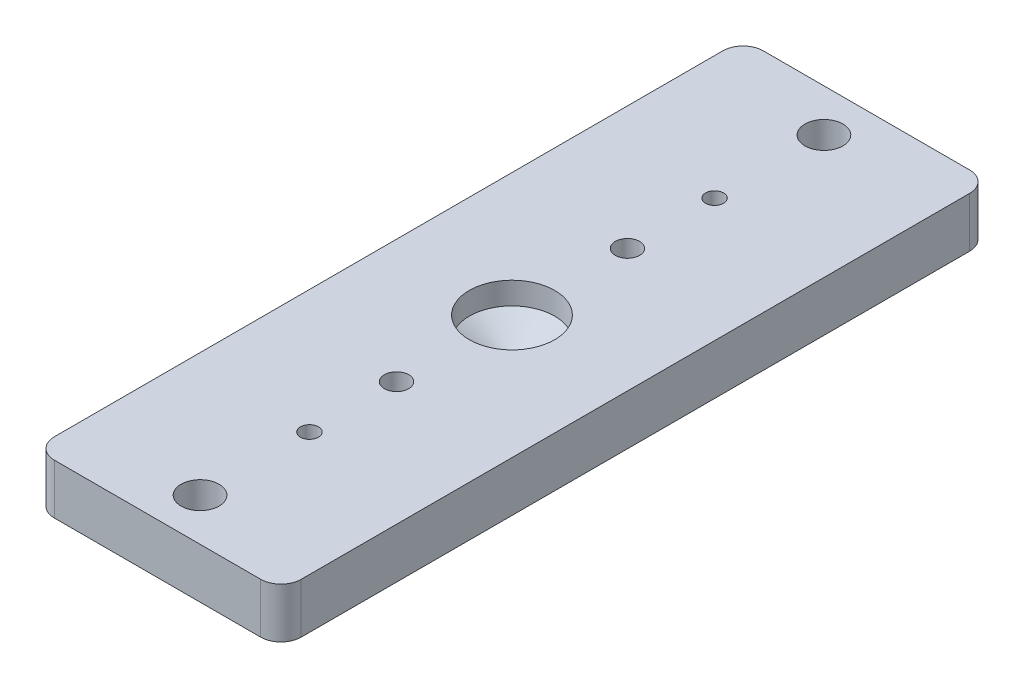
ISO-10303-21;
HEADER;
FILE_DESCRIPTION(('STEP AP214'),'2;1');
FILE_NAME('part.step','',(''),(''),'','','');
FILE_SCHEMA(('AUTOMOTIVE_DESIGN { 1 0 10303 214 1 1 1 1 }'));
ENDSEC;
DATA;
#1=APPLICATION_CONTEXT('core data for automotive mechanical design processes');
#2=APPLICATION_PROTOCOL_DEFINITION('international standard','automotive_design',2000,#1);
#3=PRODUCT_CONTEXT('',#1,'mechanical');
#4=PRODUCT('Part','Part','',(#3));
#5=PRODUCT_RELATED_PRODUCT_CATEGORY('part','',(#4));
#6=PRODUCT_DEFINITION_FORMATION('','',#4);
#7=PRODUCT_DEFINITION_CONTEXT('part definition',#1,'design');
#8=PRODUCT_DEFINITION('design','',#6,#7);
#9=PRODUCT_DEFINITION_SHAPE('','',#8);
#10=(LENGTH_UNIT() NAMED_UNIT(*) SI_UNIT(.MILLI.,.METRE.));
#11=(NAMED_UNIT(*) PLANE_ANGLE_UNIT() SI_UNIT($,.RADIAN.));
#12=(NAMED_UNIT(*) SI_UNIT($,.STERADIAN.) SOLID_ANGLE_UNIT());
#13=UNCERTAINTY_MEASURE_WITH_UNIT(LENGTH_MEASURE(1.E-05),#10,'distance_accuracy_value','');
#14=(GEOMETRIC_REPRESENTATION_CONTEXT(3) GLOBAL_UNCERTAINTY_ASSIGNED_CONTEXT((#13)) GLOBAL_UNIT_ASSIGNED_CONTEXT((#10,
#11,#12)) REPRESENTATION_CONTEXT('',''));
#15=CARTESIAN_POINT('',(0.,0.,0.));
#16=DIRECTION('',(0.,0.,1.));
#17=DIRECTION('',(1.,0.,0.));
#18=AXIS2_PLACEMENT_3D('',#15,#16,#17);
#19=CARTESIAN_POINT('',(0.,4.7625,-14.478));
#20=DIRECTION('',(0.,-1.,0.));
#21=DIRECTION('',(0.,0.,-1.));
#22=AXIS2_PLACEMENT_3D('',#19,#20,#21);
#23=CYLINDRICAL_SURFACE('',#22,1.524);
#24=CARTESIAN_POINT('',(0.,4.7625,-14.478));
#25=DIRECTION('',(0.,-1.,0.));
#26=DIRECTION('',(0.,0.,1.));
#27=AXIS2_PLACEMENT_3D('',#24,#25,#26);
#28=CIRCLE('',#27,1.524);
#29=CARTESIAN_POINT('',(0.,4.7625,-12.954));
#30=VERTEX_POINT('',#29);
#31=EDGE_CURVE('E177',#30,#30,#28,.T.);
#32=ORIENTED_EDGE('',*,*,#31,.F.);
#33=EDGE_LOOP('',(#32));
#34=FACE_BOUND('',#33,.T.);
#35=CARTESIAN_POINT('',(0.,1.778,-14.478));
#36=DIRECTION('',(0.,-1.,0.));
#37=DIRECTION('',(0.,0.,-1.));
#38=AXIS2_PLACEMENT_3D('',#35,#36,#37);
#39=CIRCLE('',#38,1.524);
#40=CARTESIAN_POINT('',(0.,1.778,-16.002));
#41=VERTEX_POINT('',#40);
#42=EDGE_CURVE('E125',#41,#41,#39,.F.);
#43=ORIENTED_EDGE('',*,*,#42,.F.);
#44=EDGE_LOOP('',(#43));
#45=FACE_BOUND('',#44,.T.);
#46=ADVANCED_FACE('F34',(#34,#45),#23,.F.);
#47=CARTESIAN_POINT('',(12.938125,-1.524,-41.91));
#48=DIRECTION('',(0.,-1.,0.));
#49=DIRECTION('',(0.,0.,-1.));
#50=AXIS2_PLACEMENT_3D('',#47,#48,#49);
#51=PLANE('',#50);
#52=CARTESIAN_POINT('',(0.,-1.524,14.478));
#53=DIRECTION('',(0.,-1.,0.));
#54=DIRECTION('',(0.,0.,1.));
#55=AXIS2_PLACEMENT_3D('',#52,#53,#54);
#56=CIRCLE('',#55,3.175);
#57=CARTESIAN_POINT('',(0.,-1.524,17.653));
#58=VERTEX_POINT('',#57);
#59=EDGE_CURVE('E111',#58,#58,#56,.T.);
#60=ORIENTED_EDGE('',*,*,#59,.F.);
#61=EDGE_LOOP('',(#60));
#62=FACE_BOUND('',#61,.T.);
#63=CARTESIAN_POINT('',(0.,-1.524,-14.478));
#64=DIRECTION('',(0.,-1.,0.));
#65=DIRECTION('',(0.,0.,-1.));
#66=AXIS2_PLACEMENT_3D('',#63,#64,#65);
#67=CIRCLE('',#66,3.175);
#68=CARTESIAN_POINT('',(0.,-1.524,-17.653));
#69=VERTEX_POINT('',#68);
#70=EDGE_CURVE('E126',#69,#69,#67,.T.);
#71=ORIENTED_EDGE('',*,*,#70,.F.);
#72=EDGE_LOOP('',(#71));
#73=FACE_BOUND('',#72,.T.);
#74=CARTESIAN_POINT('',(0.,-1.524,25.4));
#75=DIRECTION('',(0.,1.,0.));
#76=DIRECTION('',(0.,0.,1.));
#77=AXIS2_PLACEMENT_3D('',#74,#75,#76);
#78=CIRCLE('',#77,1.1303);
#79=CARTESIAN_POINT('',(0.,-1.524,26.5303));
#80=VERTEX_POINT('',#79);
#81=EDGE_CURVE('E132',#80,#80,#78,.T.);
#82=ORIENTED_EDGE('',*,*,#81,.T.);
#83=EDGE_LOOP('',(#82));
#84=FACE_BOUND('',#83,.T.);
#85=CARTESIAN_POINT('',(12.938125,-1.524,-41.91));
#86=DIRECTION('',(0.,-1.,0.));
#87=DIRECTION('',(0.,0.,-1.));
#88=AXIS2_PLACEMENT_3D('',#85,#86,#87);
#89=CIRCLE('',#88,2.54);
#90=CARTESIAN_POINT('',(12.938125,-1.524,-44.45));
#91=VERTEX_POINT('',#90);
#92=CARTESIAN_POINT('',(15.478125,-1.524,-41.91));
#93=VERTEX_POINT('',#92);
#94=EDGE_CURVE('E141',#91,#93,#89,.T.);
#95=ORIENTED_EDGE('',*,*,#94,.T.);
#96=DIRECTION('',(0.,0.,1.));
#97=VECTOR('',#96,1.);
#98=CARTESIAN_POINT('',(15.478125,-1.524,41.91));
#99=LINE('',#98,#97);
#100=CARTESIAN_POINT('',(15.478125,-1.524,41.91));
#101=VERTEX_POINT('',#100);
#102=EDGE_CURVE('E144',#93,#101,#99,.T.);
#103=ORIENTED_EDGE('',*,*,#102,.T.);
#104=CARTESIAN_POINT('',(12.938125,-1.524,41.91));
#105=DIRECTION('',(0.,-1.,0.));
#106=DIRECTION('',(0.,0.,-1.));
#107=AXIS2_PLACEMENT_3D('',#104,#105,#106);
#108=CIRCLE('',#107,2.54000000000001);
#109=CARTESIAN_POINT('',(12.938125,-1.524,44.45));
#110=VERTEX_POINT('',#109);
#111=EDGE_CURVE('E147',#101,#110,#108,.T.);
#112=ORIENTED_EDGE('',*,*,#111,.T.);
#113=DIRECTION('',(-1.,0.,0.));
#114=VECTOR('',#113,1.);
#115=CARTESIAN_POINT('',(-12.938125,-1.524,44.45));
#116=LINE('',#115,#114);
#117=CARTESIAN_POINT('',(-12.938125,-1.524,44.45));
#118=VERTEX_POINT('',#117);
#119=EDGE_CURVE('E150',#110,#118,#116,.T.);
#120=ORIENTED_EDGE('',*,*,#119,.T.);
#121=CARTESIAN_POINT('',(-12.938125,-1.524,41.91));
#122=DIRECTION('',(0.,-1.,0.));
#123=DIRECTION('',(0.,0.,-1.));
#124=AXIS2_PLACEMENT_3D('',#121,#122,#123);
#125=CIRCLE('',#124,2.54);
#126=CARTESIAN_POINT('',(-15.478125,-1.524,41.91));
#127=VERTEX_POINT('',#126);
#128=EDGE_CURVE('E153',#118,#127,#125,.T.);
#129=ORIENTED_EDGE('',*,*,#128,.T.);
#130=DIRECTION('',(0.,0.,-1.));
#131=VECTOR('',#130,1.);
#132=CARTESIAN_POINT('',(-15.478125,-1.524,-41.91));
#133=LINE('',#132,#131);
#134=CARTESIAN_POINT('',(-15.478125,-1.524,-41.91));
#135=VERTEX_POINT('',#134);
#136=EDGE_CURVE('E156',#127,#135,#133,.T.);
#137=ORIENTED_EDGE('',*,*,#136,.T.);
#138=CARTESIAN_POINT('',(-12.938125,-1.524,-41.91));
#139=DIRECTION('',(0.,-1.,0.));
#140=DIRECTION('',(0.,0.,-1.));
#141=AXIS2_PLACEMENT_3D('',#138,#139,#140);
#142=CIRCLE('',#141,2.54000000000001);
#143=CARTESIAN_POINT('',(-12.938125,-1.524,-44.45));
#144=VERTEX_POINT('',#143);
#145=EDGE_CURVE('E159',#135,#144,#142,.T.);
#146=ORIENTED_EDGE('',*,*,#145,.T.);
#147=DIRECTION('',(1.,0.,0.));
#148=VECTOR('',#147,1.);
#149=CARTESIAN_POINT('',(12.938125,-1.524,-44.45));
#150=LINE('',#149,#148);
#151=EDGE_CURVE('E162',#144,#91,#150,.T.);
#152=ORIENTED_EDGE('',*,*,#151,.T.);
#153=EDGE_LOOP('',(#95,#103,#112,#120,#129,#137,#146,#152));
#154=FACE_BOUND('',#153,.T.);
#155=CARTESIAN_POINT('',(0.,-1.524,-25.4));
#156=DIRECTION('',(0.,1.,0.));
#157=DIRECTION('',(0.,0.,1.));
#158=AXIS2_PLACEMENT_3D('',#155,#156,#157);
#159=CIRCLE('',#158,1.1303);
#160=CARTESIAN_POINT('',(0.,-1.524,-24.2697));
#161=VERTEX_POINT('',#160);
#162=EDGE_CURVE('E138',#161,#161,#159,.T.);
#163=ORIENTED_EDGE('',*,*,#162,.T.);
#164=EDGE_LOOP('',(#163));
#165=FACE_BOUND('',#164,.T.);
#166=ADVANCED_FACE('F218',(#62,#73,#84,#154,#165),#51,.T.);
#167=CARTESIAN_POINT('',(-15.478125,4.7625,-44.45));
#168=DIRECTION('',(0.,0.,1.));
#169=DIRECTION('',(1.,0.,0.));
#170=AXIS2_PLACEMENT_3D('',#167,#168,#169);
#171=PLANE('',#170);
#172=DIRECTION('',(-1.,0.,0.));
#173=VECTOR('',#172,1.);
#174=CARTESIAN_POINT('',(-15.478125,4.7625,-44.45));
#175=LINE('',#174,#173);
#176=CARTESIAN_POINT('',(12.938125,4.7625,-44.45));
#177=VERTEX_POINT('',#176);
#178=CARTESIAN_POINT('',(-12.938125,4.7625,-44.45));
#179=VERTEX_POINT('',#178);
#180=EDGE_CURVE('E183',#177,#179,#175,.T.);
#181=ORIENTED_EDGE('',*,*,#180,.F.);
#182=DIRECTION('',(0.,-1.,0.));
#183=VECTOR('',#182,1.);
#184=CARTESIAN_POINT('',(12.938125,4.7625,-44.45));
#185=LINE('',#184,#183);
#186=EDGE_CURVE('E195',#177,#91,#185,.T.);
#187=ORIENTED_EDGE('',*,*,#186,.T.);
#188=ORIENTED_EDGE('',*,*,#151,.F.);
#189=DIRECTION('',(0.,-1.,0.));
#190=VECTOR('',#189,1.);
#191=CARTESIAN_POINT('',(-12.938125,4.7625,-44.45));
#192=LINE('',#191,#190);
#193=EDGE_CURVE('E193',#144,#179,#192,.F.);
#194=ORIENTED_EDGE('',*,*,#193,.T.);
#195=EDGE_LOOP('',(#181,#187,#188,#194));
#196=FACE_BOUND('',#195,.T.);
#197=ADVANCED_FACE('F224',(#196),#171,.F.);
#198=CARTESIAN_POINT('',(-15.478125,4.7625,44.45));
#199=DIRECTION('',(1.,0.,0.));
#200=DIRECTION('',(0.,0.,-1.));
#201=AXIS2_PLACEMENT_3D('',#198,#199,#200);
#202=PLANE('',#201);
#203=DIRECTION('',(0.,0.,1.));
#204=VECTOR('',#203,1.);
#205=CARTESIAN_POINT('',(-15.478125,4.7625,44.45));
#206=LINE('',#205,#204);
#207=CARTESIAN_POINT('',(-15.478125,4.7625,-41.91));
#208=VERTEX_POINT('',#207);
#209=CARTESIAN_POINT('',(-15.478125,4.7625,41.91));
#210=VERTEX_POINT('',#209);
#211=EDGE_CURVE('E186',#208,#210,#206,.T.);
#212=ORIENTED_EDGE('',*,*,#211,.F.);
#213=DIRECTION('',(0.,-1.,0.));
#214=VECTOR('',#213,1.);
#215=CARTESIAN_POINT('',(-15.478125,4.7625,-41.91));
#216=LINE('',#215,#214);
#217=EDGE_CURVE('E210',#208,#135,#216,.T.);
#218=ORIENTED_EDGE('',*,*,#217,.T.);
#219=ORIENTED_EDGE('',*,*,#136,.F.);
#220=DIRECTION('',(0.,-1.,0.));
#221=VECTOR('',#220,1.);
#222=CARTESIAN_POINT('',(-15.478125,4.7625,41.91));
#223=LINE('',#222,#221);
#224=EDGE_CURVE('E208',#127,#210,#223,.F.);
#225=ORIENTED_EDGE('',*,*,#224,.T.);
#226=EDGE_LOOP('',(#212,#218,#219,#225));
#227=FACE_BOUND('',#226,.T.);
#228=ADVANCED_FACE('F248',(#227),#202,.F.);
#229=CARTESIAN_POINT('',(-15.478125,4.7625,44.45));
#230=DIRECTION('',(0.,0.,-1.));
#231=DIRECTION('',(-1.,0.,0.));
#232=AXIS2_PLACEMENT_3D('',#229,#230,#231);
#233=PLANE('',#232);
#234=DIRECTION('',(0.,-1.,0.));
#235=VECTOR('',#234,1.);
#236=CARTESIAN_POINT('',(-12.938125,4.7625,44.45));
#237=LINE('',#236,#235);
#238=CARTESIAN_POINT('',(-12.938125,4.7625,44.45));
#239=VERTEX_POINT('',#238);
#240=EDGE_CURVE('E43',#239,#118,#237,.T.);
#241=ORIENTED_EDGE('',*,*,#240,.T.);
#242=ORIENTED_EDGE('',*,*,#119,.F.);
#243=DIRECTION('',(0.,-1.,0.));
#244=VECTOR('',#243,1.);
#245=CARTESIAN_POINT('',(12.938125,4.7625,44.45));
#246=LINE('',#245,#244);
#247=CARTESIAN_POINT('',(12.938125,4.7625,44.45));
#248=VERTEX_POINT('',#247);
#249=EDGE_CURVE('E11',#110,#248,#246,.F.);
#250=ORIENTED_EDGE('',*,*,#249,.T.);
#251=DIRECTION('',(1.,0.,0.));
#252=VECTOR('',#251,1.);
#253=CARTESIAN_POINT('',(-15.478125,4.7625,44.45));
#254=LINE('',#253,#252);
#255=EDGE_CURVE('E188',#239,#248,#254,.T.);
#256=ORIENTED_EDGE('',*,*,#255,.F.);
#257=EDGE_LOOP('',(#241,#242,#250,#256));
#258=FACE_BOUND('',#257,.T.);
#259=ADVANCED_FACE('F244',(#258),#233,.F.);
#260=CARTESIAN_POINT('',(15.478125,4.7625,-44.45));
#261=DIRECTION('',(-1.,0.,0.));
#262=DIRECTION('',(0.,0.,1.));
#263=AXIS2_PLACEMENT_3D('',#260,#261,#262);
#264=PLANE('',#263);
#265=DIRECTION('',(0.,-1.,0.));
#266=VECTOR('',#265,1.);
#267=CARTESIAN_POINT('',(15.478125,4.7625,41.91));
#268=LINE('',#267,#266);
#269=CARTESIAN_POINT('',(15.478125,4.7625,41.91));
#270=VERTEX_POINT('',#269);
#271=EDGE_CURVE('E197',#270,#101,#268,.T.);
#272=ORIENTED_EDGE('',*,*,#271,.T.);
#273=ORIENTED_EDGE('',*,*,#102,.F.);
#274=DIRECTION('',(0.,-1.,0.));
#275=VECTOR('',#274,1.);
#276=CARTESIAN_POINT('',(15.478125,4.7625,-41.91));
#277=LINE('',#276,#275);
#278=CARTESIAN_POINT('',(15.478125,4.7625,-41.91));
#279=VERTEX_POINT('',#278);
#280=EDGE_CURVE('E199',#93,#279,#277,.F.);
#281=ORIENTED_EDGE('',*,*,#280,.T.);
#282=DIRECTION('',(0.,0.,-1.));
#283=VECTOR('',#282,1.);
#284=CARTESIAN_POINT('',(15.478125,4.7625,-44.45));
#285=LINE('',#284,#283);
#286=EDGE_CURVE('E190',#270,#279,#285,.T.);
#287=ORIENTED_EDGE('',*,*,#286,.F.);
#288=EDGE_LOOP('',(#272,#273,#281,#287));
#289=FACE_BOUND('',#288,.T.);
#290=ADVANCED_FACE('F240',(#289),#264,.F.);
#291=CARTESIAN_POINT('',(15.478125,4.7625,-44.45));
#292=DIRECTION('',(0.,-1.,0.));
#293=DIRECTION('',(0.,0.,-1.));
#294=AXIS2_PLACEMENT_3D('',#291,#292,#293);
#295=PLANE('',#294);
#296=CARTESIAN_POINT('',(0.,4.7625,0.));
#297=DIRECTION('',(0.,1.,0.));
#298=DIRECTION('',(0.,0.,1.));
#299=AXIS2_PLACEMENT_3D('',#296,#297,#298);
#300=CIRCLE('',#299,5.35812999999999);
#301=CARTESIAN_POINT('',(0.,4.7625,5.35812999999999));
#302=VERTEX_POINT('',#301);
#303=EDGE_CURVE('E112',#302,#302,#300,.T.);
#304=ORIENTED_EDGE('',*,*,#303,.F.);
#305=EDGE_LOOP('',(#304));
#306=FACE_BOUND('',#305,.T.);
#307=CARTESIAN_POINT('',(0.,4.7625,25.4));
#308=DIRECTION('',(0.,1.,0.));
#309=DIRECTION('',(0.,0.,1.));
#310=AXIS2_PLACEMENT_3D('',#307,#308,#309);
#311=CIRCLE('',#310,1.1303);
#312=CARTESIAN_POINT('',(0.,4.7625,26.5303));
#313=VERTEX_POINT('',#312);
#314=EDGE_CURVE('E129',#313,#313,#311,.T.);
#315=ORIENTED_EDGE('',*,*,#314,.F.);
#316=EDGE_LOOP('',(#315));
#317=FACE_BOUND('',#316,.T.);
#318=CARTESIAN_POINT('',(0.,4.7625,-25.4));
#319=DIRECTION('',(0.,1.,0.));
#320=DIRECTION('',(0.,0.,1.));
#321=AXIS2_PLACEMENT_3D('',#318,#319,#320);
#322=CIRCLE('',#321,1.1303);
#323=CARTESIAN_POINT('',(0.,4.7625,-24.2697));
#324=VERTEX_POINT('',#323);
#325=EDGE_CURVE('E135',#324,#324,#322,.T.);
#326=ORIENTED_EDGE('',*,*,#325,.F.);
#327=EDGE_LOOP('',(#326));
#328=FACE_BOUND('',#327,.T.);
#329=CARTESIAN_POINT('',(0.,4.7625,39.116));
#330=DIRECTION('',(0.,-1.,0.));
#331=DIRECTION('',(0.,0.,1.));
#332=AXIS2_PLACEMENT_3D('',#329,#330,#331);
#333=CIRCLE('',#332,2.38125);
#334=CARTESIAN_POINT('',(0.,4.7625,41.49725));
#335=VERTEX_POINT('',#334);
#336=EDGE_CURVE('E171',#335,#335,#333,.T.);
#337=ORIENTED_EDGE('',*,*,#336,.T.);
#338=EDGE_LOOP('',(#337));
#339=FACE_BOUND('',#338,.T.);
#340=CARTESIAN_POINT('',(0.,4.7625,-39.116));
#341=DIRECTION('',(0.,-1.,0.));
#342=DIRECTION('',(0.,0.,-1.));
#343=AXIS2_PLACEMENT_3D('',#340,#341,#342);
#344=CIRCLE('',#343,2.38125);
#345=CARTESIAN_POINT('',(0.,4.7625,-41.49725));
#346=VERTEX_POINT('',#345);
#347=EDGE_CURVE('E174',#346,#346,#344,.T.);
#348=ORIENTED_EDGE('',*,*,#347,.T.);
#349=EDGE_LOOP('',(#348));
#350=FACE_BOUND('',#349,.T.);
#351=ORIENTED_EDGE('',*,*,#31,.T.);
#352=EDGE_LOOP('',(#351));
#353=FACE_BOUND('',#352,.T.);
#354=CARTESIAN_POINT('',(0.,4.7625,14.478));
#355=DIRECTION('',(0.,-1.,0.));
#356=DIRECTION('',(0.,0.,-1.));
#357=AXIS2_PLACEMENT_3D('',#354,#355,#356);
#358=CIRCLE('',#357,1.524);
#359=CARTESIAN_POINT('',(0.,4.7625,12.954));
#360=VERTEX_POINT('',#359);
#361=EDGE_CURVE('E180',#360,#360,#358,.T.);
#362=ORIENTED_EDGE('',*,*,#361,.T.);
#363=EDGE_LOOP('',(#362));
#364=FACE_BOUND('',#363,.T.);
#365=ORIENTED_EDGE('',*,*,#286,.T.);
#366=CARTESIAN_POINT('',(12.938125,4.7625,-41.91));
#367=DIRECTION('',(0.,-1.,0.));
#368=DIRECTION('',(0.,0.,-1.));
#369=AXIS2_PLACEMENT_3D('',#366,#367,#368);
#370=CIRCLE('',#369,2.54);
#371=EDGE_CURVE('E206',#279,#177,#370,.F.);
#372=ORIENTED_EDGE('',*,*,#371,.T.);
#373=ORIENTED_EDGE('',*,*,#180,.T.);
#374=CARTESIAN_POINT('',(-12.938125,4.7625,-41.91));
#375=DIRECTION('',(0.,-1.,0.));
#376=DIRECTION('',(0.,0.,-1.));
#377=AXIS2_PLACEMENT_3D('',#374,#375,#376);
#378=CIRCLE('',#377,2.54);
#379=EDGE_CURVE('E204',#179,#208,#378,.F.);
#380=ORIENTED_EDGE('',*,*,#379,.T.);
#381=ORIENTED_EDGE('',*,*,#211,.T.);
#382=CARTESIAN_POINT('',(-12.938125,4.7625,41.91));
#383=DIRECTION('',(0.,-1.,0.));
#384=DIRECTION('',(0.,0.,-1.));
#385=AXIS2_PLACEMENT_3D('',#382,#383,#384);
#386=CIRCLE('',#385,2.54);
#387=EDGE_CURVE('E56',#210,#239,#386,.F.);
#388=ORIENTED_EDGE('',*,*,#387,.T.);
#389=ORIENTED_EDGE('',*,*,#255,.T.);
#390=CARTESIAN_POINT('',(12.938125,4.7625,41.91));
#391=DIRECTION('',(0.,-1.,0.));
#392=DIRECTION('',(0.,0.,-1.));
#393=AXIS2_PLACEMENT_3D('',#390,#391,#392);
#394=CIRCLE('',#393,2.54);
#395=EDGE_CURVE('E202',#248,#270,#394,.F.);
#396=ORIENTED_EDGE('',*,*,#395,.T.);
#397=EDGE_LOOP('',(#365,#372,#373,#380,#381,#388,#389,#396));
#398=FACE_BOUND('',#397,.T.);
#399=ADVANCED_FACE('F236',(#306,#317,#328,#339,#350,#353,#364,#398),#295,.F.);
#400=CARTESIAN_POINT('',(12.938125,4.7625,-41.91));
#401=DIRECTION('',(0.,-1.,0.));
#402=DIRECTION('',(0.,0.,-1.));
#403=AXIS2_PLACEMENT_3D('',#400,#401,#402);
#404=CYLINDRICAL_SURFACE('',#403,2.54);
#405=ORIENTED_EDGE('',*,*,#371,.F.);
#406=ORIENTED_EDGE('',*,*,#280,.F.);
#407=ORIENTED_EDGE('',*,*,#94,.F.);
#408=ORIENTED_EDGE('',*,*,#186,.F.);
#409=EDGE_LOOP('',(#405,#406,#407,#408));
#410=FACE_BOUND('',#409,.T.);
#411=ADVANCED_FACE('F239',(#410),#404,.T.);
#412=CARTESIAN_POINT('',(-12.938125,4.7625,-41.91));
#413=DIRECTION('',(0.,-1.,0.));
#414=DIRECTION('',(0.,0.,-1.));
#415=AXIS2_PLACEMENT_3D('',#412,#413,#414);
#416=CYLINDRICAL_SURFACE('',#415,2.54);
#417=ORIENTED_EDGE('',*,*,#379,.F.);
#418=ORIENTED_EDGE('',*,*,#193,.F.);
#419=ORIENTED_EDGE('',*,*,#145,.F.);
#420=ORIENTED_EDGE('',*,*,#217,.F.);
#421=EDGE_LOOP('',(#417,#418,#419,#420));
#422=FACE_BOUND('',#421,.T.);
#423=ADVANCED_FACE('F257',(#422),#416,.T.);
#424=CARTESIAN_POINT('',(12.938125,4.7625,41.91));
#425=DIRECTION('',(0.,-1.,0.));
#426=DIRECTION('',(0.,0.,-1.));
#427=AXIS2_PLACEMENT_3D('',#424,#425,#426);
#428=CYLINDRICAL_SURFACE('',#427,2.54);
#429=ORIENTED_EDGE('',*,*,#395,.F.);
#430=ORIENTED_EDGE('',*,*,#249,.F.);
#431=ORIENTED_EDGE('',*,*,#111,.F.);
#432=ORIENTED_EDGE('',*,*,#271,.F.);
#433=EDGE_LOOP('',(#429,#430,#431,#432));
#434=FACE_BOUND('',#433,.T.);
#435=ADVANCED_FACE('F260',(#434),#428,.T.);
#436=CARTESIAN_POINT('',(-12.938125,4.7625,41.91));
#437=DIRECTION('',(0.,-1.,0.));
#438=DIRECTION('',(0.,0.,-1.));
#439=AXIS2_PLACEMENT_3D('',#436,#437,#438);
#440=CYLINDRICAL_SURFACE('',#439,2.54);
#441=ORIENTED_EDGE('',*,*,#387,.F.);
#442=ORIENTED_EDGE('',*,*,#224,.F.);
#443=ORIENTED_EDGE('',*,*,#128,.F.);
#444=ORIENTED_EDGE('',*,*,#240,.F.);
#445=EDGE_LOOP('',(#441,#442,#443,#444));
#446=FACE_BOUND('',#445,.T.);
#447=ADVANCED_FACE('F36',(#446),#440,.T.);
#448=CARTESIAN_POINT('',(0.,4.7625,14.478));
#449=DIRECTION('',(0.,-1.,0.));
#450=DIRECTION('',(0.,0.,-1.));
#451=AXIS2_PLACEMENT_3D('',#448,#449,#450);
#452=CYLINDRICAL_SURFACE('',#451,1.524);
#453=CARTESIAN_POINT('',(0.,1.778,14.478));
#454=DIRECTION('',(0.,1.,0.));
#455=DIRECTION('',(0.,0.,1.));
#456=AXIS2_PLACEMENT_3D('',#453,#454,#455);
#457=CIRCLE('',#456,1.524);
#458=CARTESIAN_POINT('',(0.,1.778,16.002));
#459=VERTEX_POINT('',#458);
#460=EDGE_CURVE('E38',#459,#459,#457,.F.);
#461=ORIENTED_EDGE('',*,*,#460,.T.);
#462=EDGE_LOOP('',(#461));
#463=FACE_BOUND('',#462,.T.);
#464=ORIENTED_EDGE('',*,*,#361,.F.);
#465=EDGE_LOOP('',(#464));
#466=FACE_BOUND('',#465,.T.);
#467=ADVANCED_FACE('F232',(#463,#466),#452,.F.);
#468=CARTESIAN_POINT('',(0.,4.7625,-39.116));
#469=DIRECTION('',(0.,-1.,0.));
#470=DIRECTION('',(0.,0.,-1.));
#471=AXIS2_PLACEMENT_3D('',#468,#469,#470);
#472=CYLINDRICAL_SURFACE('',#471,2.38125);
#473=ORIENTED_EDGE('',*,*,#347,.F.);
#474=EDGE_LOOP('',(#473));
#475=FACE_BOUND('',#474,.T.);
#476=CARTESIAN_POINT('',(0.,0.,-39.116));
#477=DIRECTION('',(0.,-1.,0.));
#478=DIRECTION('',(0.,0.,-1.));
#479=AXIS2_PLACEMENT_3D('',#476,#477,#478);
#480=CIRCLE('',#479,2.38125);
#481=CARTESIAN_POINT('',(0.,0.,-41.49725));
#482=VERTEX_POINT('',#481);
#483=EDGE_CURVE('E168',#482,#482,#480,.F.);
#484=ORIENTED_EDGE('',*,*,#483,.F.);
#485=EDGE_LOOP('',(#484));
#486=FACE_BOUND('',#485,.T.);
#487=ADVANCED_FACE('F230',(#475,#486),#472,.F.);
#488=CARTESIAN_POINT('',(0.,4.7625,39.116));
#489=DIRECTION('',(0.,-1.,0.));
#490=DIRECTION('',(0.,0.,-1.));
#491=AXIS2_PLACEMENT_3D('',#488,#489,#490);
#492=CYLINDRICAL_SURFACE('',#491,2.38125);
#493=ORIENTED_EDGE('',*,*,#336,.F.);
#494=EDGE_LOOP('',(#493));
#495=FACE_BOUND('',#494,.T.);
#496=CARTESIAN_POINT('',(0.,0.,39.116));
#497=DIRECTION('',(0.,-1.,0.));
#498=DIRECTION('',(0.,0.,-1.));
#499=AXIS2_PLACEMENT_3D('',#496,#497,#498);
#500=CIRCLE('',#499,2.38125);
#501=CARTESIAN_POINT('',(0.,0.,36.73475));
#502=VERTEX_POINT('',#501);
#503=EDGE_CURVE('E165',#502,#502,#500,.F.);
#504=ORIENTED_EDGE('',*,*,#503,.F.);
#505=EDGE_LOOP('',(#504));
#506=FACE_BOUND('',#505,.T.);
#507=ADVANCED_FACE('F308',(#495,#506),#492,.F.);
#508=CARTESIAN_POINT('',(12.938125,0.,-41.91));
#509=DIRECTION('',(0.,-1.,0.));
#510=DIRECTION('',(0.,0.,-1.));
#511=AXIS2_PLACEMENT_3D('',#508,#509,#510);
#512=PLANE('',#511);
#513=ORIENTED_EDGE('',*,*,#503,.T.);
#514=EDGE_LOOP('',(#513));
#515=FACE_BOUND('',#514,.T.);
#516=ADVANCED_FACE('F312',(#515),#512,.F.);
#517=ORIENTED_EDGE('',*,*,#483,.T.);
#518=EDGE_LOOP('',(#517));
#519=FACE_BOUND('',#518,.T.);
#520=ADVANCED_FACE('F293',(#519),#512,.F.);
#521=CARTESIAN_POINT('',(0.,4.7625,-25.4));
#522=DIRECTION('',(0.,1.,0.));
#523=DIRECTION('',(0.,0.,1.));
#524=AXIS2_PLACEMENT_3D('',#521,#522,#523);
#525=CYLINDRICAL_SURFACE('',#524,1.1303);
#526=ORIENTED_EDGE('',*,*,#162,.F.);
#527=EDGE_LOOP('',(#526));
#528=FACE_BOUND('',#527,.T.);
#529=ORIENTED_EDGE('',*,*,#325,.T.);
#530=EDGE_LOOP('',(#529));
#531=FACE_BOUND('',#530,.T.);
#532=ADVANCED_FACE('F289',(#528,#531),#525,.F.);
#533=CARTESIAN_POINT('',(0.,4.7625,25.4));
#534=DIRECTION('',(0.,1.,0.));
#535=DIRECTION('',(0.,0.,1.));
#536=AXIS2_PLACEMENT_3D('',#533,#534,#535);
#537=CYLINDRICAL_SURFACE('',#536,1.1303);
#538=ORIENTED_EDGE('',*,*,#81,.F.);
#539=EDGE_LOOP('',(#538));
#540=FACE_BOUND('',#539,.T.);
#541=ORIENTED_EDGE('',*,*,#314,.T.);
#542=EDGE_LOOP('',(#541));
#543=FACE_BOUND('',#542,.T.);
#544=ADVANCED_FACE('F292',(#540,#543),#537,.F.);
#545=CARTESIAN_POINT('',(0.,1.778,-14.478));
#546=DIRECTION('',(0.,-1.,0.));
#547=DIRECTION('',(0.,0.,-1.));
#548=AXIS2_PLACEMENT_3D('',#545,#546,#547);
#549=PLANE('',#548);
#550=CARTESIAN_POINT('',(0.,1.778,-14.478));
#551=DIRECTION('',(0.,-1.,0.));
#552=DIRECTION('',(0.,0.,-1.));
#553=AXIS2_PLACEMENT_3D('',#550,#551,#552);
#554=CIRCLE('',#553,3.175);
#555=CARTESIAN_POINT('',(0.,1.778,-17.653));
#556=VERTEX_POINT('',#555);
#557=EDGE_CURVE('E122',#556,#556,#554,.T.);
#558=ORIENTED_EDGE('',*,*,#557,.T.);
#559=EDGE_LOOP('',(#558));
#560=FACE_BOUND('',#559,.T.);
#561=ORIENTED_EDGE('',*,*,#42,.T.);
#562=EDGE_LOOP('',(#561));
#563=FACE_BOUND('',#562,.T.);
#564=ADVANCED_FACE('F215',(#560,#563),#549,.T.);
#565=CARTESIAN_POINT('',(0.,1.778,-14.478));
#566=DIRECTION('',(0.,-1.,0.));
#567=DIRECTION('',(0.,0.,-1.));
#568=AXIS2_PLACEMENT_3D('',#565,#566,#567);
#569=CYLINDRICAL_SURFACE('',#568,3.175);
#570=ORIENTED_EDGE('',*,*,#557,.F.);
#571=EDGE_LOOP('',(#570));
#572=FACE_BOUND('',#571,.T.);
#573=ORIENTED_EDGE('',*,*,#70,.T.);
#574=EDGE_LOOP('',(#573));
#575=FACE_BOUND('',#574,.T.);
#576=ADVANCED_FACE('F384',(#572,#575),#569,.F.);
#577=CARTESIAN_POINT('',(0.,1.778,14.478));
#578=DIRECTION('',(0.,1.,0.));
#579=DIRECTION('',(0.,0.,1.));
#580=AXIS2_PLACEMENT_3D('',#577,#578,#579);
#581=PLANE('',#580);
#582=CARTESIAN_POINT('',(0.,1.778,14.478));
#583=DIRECTION('',(0.,-1.,0.));
#584=DIRECTION('',(0.,0.,1.));
#585=AXIS2_PLACEMENT_3D('',#582,#583,#584);
#586=CIRCLE('',#585,3.175);
#587=CARTESIAN_POINT('',(0.,1.778,17.653));
#588=VERTEX_POINT('',#587);
#589=EDGE_CURVE('E115',#588,#588,#586,.T.);
#590=ORIENTED_EDGE('',*,*,#589,.T.);
#591=EDGE_LOOP('',(#590));
#592=FACE_BOUND('',#591,.T.);
#593=ORIENTED_EDGE('',*,*,#460,.F.);
#594=EDGE_LOOP('',(#593));
#595=FACE_BOUND('',#594,.T.);
#596=ADVANCED_FACE('F394',(#592,#595),#581,.F.);
#597=CARTESIAN_POINT('',(0.,1.778,14.478));
#598=DIRECTION('',(0.,-1.,0.));
#599=DIRECTION('',(0.,0.,-1.));
#600=AXIS2_PLACEMENT_3D('',#597,#598,#599);
#601=CYLINDRICAL_SURFACE('',#600,3.175);
#602=ORIENTED_EDGE('',*,*,#589,.F.);
#603=EDGE_LOOP('',(#602));
#604=FACE_BOUND('',#603,.T.);
#605=ORIENTED_EDGE('',*,*,#59,.T.);
#606=EDGE_LOOP('',(#605));
#607=FACE_BOUND('',#606,.T.);
#608=ADVANCED_FACE('F105',(#604,#607),#601,.F.);
#609=CARTESIAN_POINT('',(0.,1.9685,0.));
#610=DIRECTION('',(0.,1.,0.));
#611=DIRECTION('',(0.,0.,1.));
#612=AXIS2_PLACEMENT_3D('',#609,#610,#611);
#613=CONICAL_SURFACE('',#612,5.35813,1.02974425867665);
#614=CARTESIAN_POINT('',(0.,-1.25098930863014,0.));
#615=VERTEX_POINT('',#614);
#616=VERTEX_LOOP('',#615);
#617=FACE_BOUND('',#616,.T.);
#618=CARTESIAN_POINT('',(0.,1.9685,0.));
#619=DIRECTION('',(0.,1.,0.));
#620=DIRECTION('',(0.,0.,1.));
#621=AXIS2_PLACEMENT_3D('',#618,#619,#620);
#622=CIRCLE('',#621,5.35813);
#623=CARTESIAN_POINT('',(0.,1.9685,5.35813));
#624=VERTEX_POINT('',#623);
#625=EDGE_CURVE('E109',#624,#624,#622,.T.);
#626=ORIENTED_EDGE('',*,*,#625,.T.);
#627=EDGE_LOOP('',(#626));
#628=FACE_BOUND('',#627,.T.);
#629=ADVANCED_FACE('F101',(#617,#628),#613,.F.);
#630=CARTESIAN_POINT('',(0.,4.7625,0.));
#631=DIRECTION('',(0.,1.,0.));
#632=DIRECTION('',(0.,0.,1.));
#633=AXIS2_PLACEMENT_3D('',#630,#631,#632);
#634=CYLINDRICAL_SURFACE('',#633,5.35812999999999);
#635=ORIENTED_EDGE('',*,*,#625,.F.);
#636=EDGE_LOOP('',(#635));
#637=FACE_BOUND('',#636,.T.);
#638=ORIENTED_EDGE('',*,*,#303,.T.);
#639=EDGE_LOOP('',(#638));
#640=FACE_BOUND('',#639,.T.);
#641=ADVANCED_FACE('F104',(#637,#640),#634,.F.);
#642=CLOSED_SHELL('',(#46,#166,#197,#228,#259,#290,#399,#411,#423,#435,#447,#467,#487,#507,#516,
#520,#532,#544,#564,#576,#596,#608,#629,#641));
#643=MANIFOLD_SOLID_BREP('B2',#642);
#644=ADVANCED_BREP_SHAPE_REPRESENTATION('',(#18,#643),#14);
#645=SHAPE_DEFINITION_REPRESENTATION(#9,#644);
ENDSEC;
END-ISO-10303-21;
